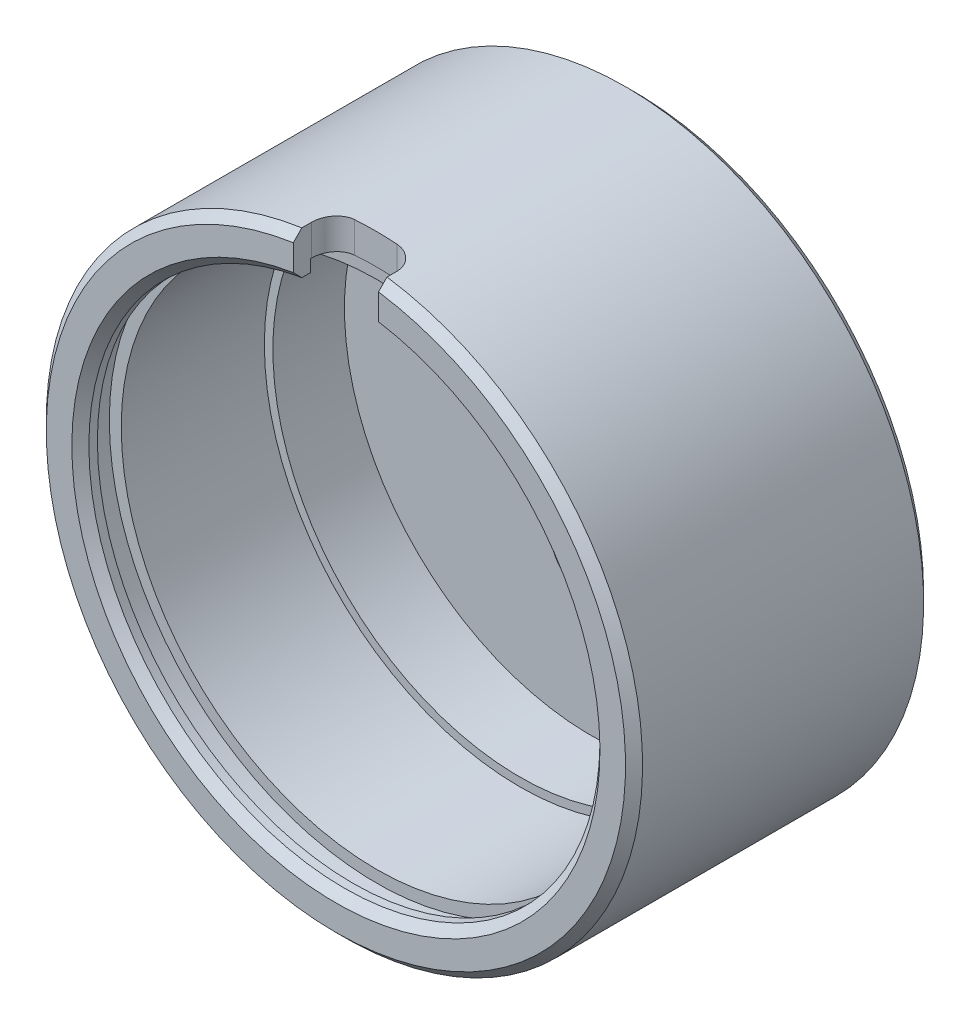
ISO-10303-21;
HEADER;
FILE_DESCRIPTION(('STEP AP214'),'2;1');
FILE_NAME('part.step','',(''),(''),'','','');
FILE_SCHEMA(('AUTOMOTIVE_DESIGN { 1 0 10303 214 1 1 1 1 }'));
ENDSEC;
DATA;
#1=APPLICATION_CONTEXT('core data for automotive mechanical design processes');
#2=APPLICATION_PROTOCOL_DEFINITION('international standard','automotive_design',2000,#1);
#3=PRODUCT_CONTEXT('',#1,'mechanical');
#4=PRODUCT('Part','Part','',(#3));
#5=PRODUCT_RELATED_PRODUCT_CATEGORY('part','',(#4));
#6=PRODUCT_DEFINITION_FORMATION('','',#4);
#7=PRODUCT_DEFINITION_CONTEXT('part definition',#1,'design');
#8=PRODUCT_DEFINITION('design','',#6,#7);
#9=PRODUCT_DEFINITION_SHAPE('','',#8);
#10=(LENGTH_UNIT() NAMED_UNIT(*) SI_UNIT(.MILLI.,.METRE.));
#11=(NAMED_UNIT(*) PLANE_ANGLE_UNIT() SI_UNIT($,.RADIAN.));
#12=(NAMED_UNIT(*) SI_UNIT($,.STERADIAN.) SOLID_ANGLE_UNIT());
#13=UNCERTAINTY_MEASURE_WITH_UNIT(LENGTH_MEASURE(1.E-05),#10,'distance_accuracy_value','');
#14=(GEOMETRIC_REPRESENTATION_CONTEXT(3) GLOBAL_UNCERTAINTY_ASSIGNED_CONTEXT((#13)) GLOBAL_UNIT_ASSIGNED_CONTEXT((#10,
#11,#12)) REPRESENTATION_CONTEXT('',''));
#15=CARTESIAN_POINT('',(0.,0.,0.));
#16=DIRECTION('',(0.,0.,1.));
#17=DIRECTION('',(1.,0.,0.));
#18=AXIS2_PLACEMENT_3D('',#15,#16,#17);
#19=CARTESIAN_POINT('',(0.,-36.83,-10.16));
#20=DIRECTION('',(0.,0.,1.));
#21=DIRECTION('',(1.,0.,0.));
#22=AXIS2_PLACEMENT_3D('',#19,#20,#21);
#23=PLANE('',#22);
#24=CARTESIAN_POINT('',(-0.800871738990831,-13.9328498086649,-10.16));
#25=DIRECTION('',(0.,0.,1.));
#26=DIRECTION('',(1.,0.,0.));
#27=AXIS2_PLACEMENT_3D('',#24,#25,#26);
#28=CIRCLE('',#27,5.207);
#29=CARTESIAN_POINT('',(4.40612826100917,-13.9328498086649,-10.16));
#30=VERTEX_POINT('',#29);
#31=EDGE_CURVE('E585',#30,#30,#28,.F.);
#32=ORIENTED_EDGE('',*,*,#31,.T.);
#33=EDGE_LOOP('',(#32));
#34=FACE_BOUND('',#33,.T.);
#35=CARTESIAN_POINT('',(-6.33232695472631,14.1088287151603,-10.16));
#36=DIRECTION('',(0.,0.,1.));
#37=DIRECTION('',(1.,0.,0.));
#38=AXIS2_PLACEMENT_3D('',#35,#36,#37);
#39=CIRCLE('',#38,3.3);
#40=CARTESIAN_POINT('',(-3.03232695472631,14.1088287151603,-10.16));
#41=VERTEX_POINT('',#40);
#42=EDGE_CURVE('E579',#41,#41,#39,.F.);
#43=ORIENTED_EDGE('',*,*,#42,.T.);
#44=EDGE_LOOP('',(#43));
#45=FACE_BOUND('',#44,.T.);
#46=CARTESIAN_POINT('',(24.1351224598849,0.,-10.16));
#47=DIRECTION('',(0.,0.,1.));
#48=DIRECTION('',(1.,0.,0.));
#49=AXIS2_PLACEMENT_3D('',#46,#47,#48);
#50=CIRCLE('',#49,5.1562);
#51=CARTESIAN_POINT('',(29.2913224598849,0.,-10.16));
#52=VERTEX_POINT('',#51);
#53=EDGE_CURVE('E167',#52,#52,#50,.T.);
#54=ORIENTED_EDGE('',*,*,#53,.F.);
#55=EDGE_LOOP('',(#54));
#56=FACE_BOUND('',#55,.T.);
#57=CARTESIAN_POINT('',(0.,0.,-10.16));
#58=DIRECTION('',(0.,0.,1.));
#59=DIRECTION('',(1.,0.,0.));
#60=AXIS2_PLACEMENT_3D('',#57,#58,#59);
#61=CIRCLE('',#60,1.28904999999999);
#62=CARTESIAN_POINT('',(1.28904999999999,0.,-10.16));
#63=VERTEX_POINT('',#62);
#64=EDGE_CURVE('E161',#63,#63,#61,.T.);
#65=ORIENTED_EDGE('',*,*,#64,.F.);
#66=EDGE_LOOP('',(#65));
#67=FACE_BOUND('',#66,.T.);
#68=CARTESIAN_POINT('',(0.,0.,-10.16));
#69=DIRECTION('',(0.,0.,1.));
#70=DIRECTION('',(1.,0.,0.));
#71=AXIS2_PLACEMENT_3D('',#68,#69,#70);
#72=CIRCLE('',#71,36.83);
#73=CARTESIAN_POINT('',(36.83,0.,-10.16));
#74=VERTEX_POINT('',#73);
#75=EDGE_CURVE('E249',#74,#74,#72,.T.);
#76=ORIENTED_EDGE('',*,*,#75,.T.);
#77=EDGE_LOOP('',(#76));
#78=FACE_BOUND('',#77,.T.);
#79=ADVANCED_FACE('F69',(#34,#45,#56,#67,#78),#23,.T.);
#80=CARTESIAN_POINT('',(0.,0.,-16.51));
#81=DIRECTION('',(0.,0.,-1.));
#82=DIRECTION('',(-1.,0.,0.));
#83=AXIS2_PLACEMENT_3D('',#80,#81,#82);
#84=PLANE('',#83);
#85=CARTESIAN_POINT('',(-0.800871738990831,-13.9328498086649,-16.51));
#86=DIRECTION('',(0.,0.,-1.));
#87=DIRECTION('',(-1.,0.,0.));
#88=AXIS2_PLACEMENT_3D('',#85,#86,#87);
#89=CIRCLE('',#88,5.207);
#90=CARTESIAN_POINT('',(-6.00787173899083,-13.9328498086649,-16.51));
#91=VERTEX_POINT('',#90);
#92=EDGE_CURVE('E578',#91,#91,#89,.T.);
#93=ORIENTED_EDGE('',*,*,#92,.F.);
#94=EDGE_LOOP('',(#93));
#95=FACE_BOUND('',#94,.T.);
#96=CARTESIAN_POINT('',(-6.33232695472631,14.1088287151603,-16.51));
#97=DIRECTION('',(0.,0.,-1.));
#98=DIRECTION('',(-1.,0.,0.));
#99=AXIS2_PLACEMENT_3D('',#96,#97,#98);
#100=CIRCLE('',#99,3.3);
#101=CARTESIAN_POINT('',(-9.63232695472631,14.1088287151603,-16.51));
#102=VERTEX_POINT('',#101);
#103=EDGE_CURVE('E582',#102,#102,#100,.T.);
#104=ORIENTED_EDGE('',*,*,#103,.F.);
#105=EDGE_LOOP('',(#104));
#106=FACE_BOUND('',#105,.T.);
#107=CARTESIAN_POINT('',(24.1351224598849,0.,-16.51));
#108=DIRECTION('',(0.,0.,-1.));
#109=DIRECTION('',(-1.,0.,0.));
#110=AXIS2_PLACEMENT_3D('',#107,#108,#109);
#111=CIRCLE('',#110,9.525);
#112=CARTESIAN_POINT('',(14.6101224598849,0.,-16.51));
#113=VERTEX_POINT('',#112);
#114=EDGE_CURVE('E575',#113,#113,#111,.T.);
#115=ORIENTED_EDGE('',*,*,#114,.F.);
#116=EDGE_LOOP('',(#115));
#117=FACE_BOUND('',#116,.T.);
#118=CARTESIAN_POINT('',(0.,0.,-16.51));
#119=DIRECTION('',(0.,0.,-1.));
#120=DIRECTION('',(-1.,0.,0.));
#121=AXIS2_PLACEMENT_3D('',#118,#119,#120);
#122=CIRCLE('',#121,43.18);
#123=CARTESIAN_POINT('',(-43.18,0.,-16.51));
#124=VERTEX_POINT('',#123);
#125=EDGE_CURVE('E304',#124,#124,#122,.T.);
#126=ORIENTED_EDGE('',*,*,#125,.T.);
#127=EDGE_LOOP('',(#126));
#128=FACE_BOUND('',#127,.T.);
#129=ADVANCED_FACE('F334',(#95,#106,#117,#128),#84,.T.);
#130=CARTESIAN_POINT('',(0.,0.,77.4031578947368));
#131=DIRECTION('',(0.,0.,1.));
#132=DIRECTION('',(1.,0.,0.));
#133=AXIS2_PLACEMENT_3D('',#130,#131,#132);
#134=CYLINDRICAL_SURFACE('',#133,44.45);
#135=CARTESIAN_POINT('',(0.,0.,-15.24));
#136=DIRECTION('',(0.,0.,-1.));
#137=DIRECTION('',(-1.,0.,0.));
#138=AXIS2_PLACEMENT_3D('',#135,#136,#137);
#139=CIRCLE('',#138,44.45);
#140=CARTESIAN_POINT('',(-44.45,0.,-15.24));
#141=VERTEX_POINT('',#140);
#142=EDGE_CURVE('E282',#141,#141,#139,.F.);
#143=ORIENTED_EDGE('',*,*,#142,.T.);
#144=EDGE_LOOP('',(#143));
#145=FACE_BOUND('',#144,.T.);
#146=DIRECTION('',(0.,0.,1.));
#147=VECTOR('',#146,1.);
#148=CARTESIAN_POINT('',(6.35,43.9940905122495,77.4031578947368));
#149=LINE('',#148,#147);
#150=CARTESIAN_POINT('',(6.35,43.9940905122495,25.1968));
#151=VERTEX_POINT('',#150);
#152=CARTESIAN_POINT('',(6.35,43.9940905122495,26.6699999999999));
#153=VERTEX_POINT('',#152);
#154=EDGE_CURVE('E164',#151,#153,#149,.T.);
#155=ORIENTED_EDGE('',*,*,#154,.T.);
#156=CARTESIAN_POINT('',(0.,0.,26.6699999999999));
#157=DIRECTION('',(0.,0.,1.));
#158=DIRECTION('',(1.,0.,0.));
#159=AXIS2_PLACEMENT_3D('',#156,#157,#158);
#160=CIRCLE('',#159,44.45);
#161=CARTESIAN_POINT('',(-6.35,43.9940905122495,26.6699999999999));
#162=VERTEX_POINT('',#161);
#163=EDGE_CURVE('E313',#153,#162,#160,.F.);
#164=ORIENTED_EDGE('',*,*,#163,.T.);
#165=DIRECTION('',(0.,0.,1.));
#166=VECTOR('',#165,1.);
#167=CARTESIAN_POINT('',(-6.35,43.9940905122495,77.4031578947368));
#168=LINE('',#167,#166);
#169=CARTESIAN_POINT('',(-6.35,43.9940905122495,25.1968));
#170=VERTEX_POINT('',#169);
#171=EDGE_CURVE('E199',#162,#170,#168,.F.);
#172=ORIENTED_EDGE('',*,*,#171,.T.);
#173=CARTESIAN_POINT('',(-6.35,43.9940905122495,25.1968));
#174=CARTESIAN_POINT('',(-6.35000906712452,43.9940871907118,25.1080683586263));
#175=CARTESIAN_POINT('',(-6.34628039485997,43.9946273388962,25.019341226491));
#176=CARTESIAN_POINT('',(-6.33141771745465,43.9967698007436,24.8425289532975));
#177=CARTESIAN_POINT('',(-6.32028428633954,43.9983720320727,24.7544437630102));
#178=CARTESIAN_POINT('',(-6.29069877668047,44.0026115204418,24.5796322428402));
#179=CARTESIAN_POINT('',(-6.27225490035148,44.0052476174647,24.492904502894));
#180=CARTESIAN_POINT('',(-6.22820563540591,44.0115035518271,24.3213490506435));
#181=CARTESIAN_POINT('',(-6.20260029104134,44.0151233830879,24.2365213266021));
#182=CARTESIAN_POINT('',(-6.11527156229012,44.0273717624754,23.9857274174484));
#183=CARTESIAN_POINT('',(-6.04301894879132,44.0373916403267,23.8233534494161));
#184=CARTESIAN_POINT('',(-5.87265552531039,44.0604329743206,23.5131617230431));
#185=CARTESIAN_POINT('',(-5.77454619781926,44.0734542583726,23.3653431308392));
#186=CARTESIAN_POINT('',(-5.55461499748338,44.1017129183868,23.0873870955229));
#187=CARTESIAN_POINT('',(-5.4326623997553,44.1169623886948,22.9573541676829));
#188=CARTESIAN_POINT('',(-5.16881406394802,44.1486520757181,22.7195257979547));
#189=CARTESIAN_POINT('',(-5.02691387614281,44.1650925577158,22.6117353309877));
#190=CARTESIAN_POINT('',(-4.72591436649334,44.1983180962436,22.4205903646293));
#191=CARTESIAN_POINT('',(-4.56668428352384,44.2151048691079,22.3374422019247));
#192=CARTESIAN_POINT('',(-4.23647193888471,44.2479633610308,22.1991513450227));
#193=CARTESIAN_POINT('',(-4.06549652386819,44.2640354878229,22.1439924898119));
#194=CARTESIAN_POINT('',(-3.77381023101254,44.2896686903174,22.0764505130364));
#195=CARTESIAN_POINT('',(-3.6549454231235,44.2996402809604,22.0559777704057));
#196=CARTESIAN_POINT('',(-3.4157498591215,44.3187284009984,22.0286525611385));
#197=CARTESIAN_POINT('',(-3.29542118965897,44.3278460157872,22.0217825754514));
#198=CARTESIAN_POINT('',(-3.175,44.3364621389664,22.0218));
#199=B_SPLINE_CURVE_WITH_KNOTS('',3,(#173,#174,#175,#176,#177,#178,#179,#180,#181,#182,#183,
#184,#185,#186,#187,#188,#189,#190,#191,#192,#193,#194,#195,#196,#197,#198),.UNSPECIFIED.,.F.,
.F.,(4,2,2,2,2,2,2,2,2,2,2,2,4),(0.,0.266106949016901,0.53219327151295,0.797981890241406,
1.06376886665041,1.59505111623775,2.1263029114573,2.66055348014999,3.19492341424903,
3.73364894965103,4.27206307020903,4.63441276915479,4.99629549199466),.UNSPECIFIED.);
#200=CARTESIAN_POINT('',(-3.175,44.3364621389664,22.0218));
#201=VERTEX_POINT('',#200);
#202=EDGE_CURVE('E173',#170,#201,#199,.T.);
#203=ORIENTED_EDGE('',*,*,#202,.T.);
#204=CARTESIAN_POINT('',(0.,0.,22.0218));
#205=DIRECTION('',(0.,0.,-1.));
#206=DIRECTION('',(-1.,0.,0.));
#207=AXIS2_PLACEMENT_3D('',#204,#205,#206);
#208=CIRCLE('',#207,44.45);
#209=CARTESIAN_POINT('',(3.175,44.3364621389664,22.0218));
#210=VERTEX_POINT('',#209);
#211=EDGE_CURVE('E171',#201,#210,#208,.T.);
#212=ORIENTED_EDGE('',*,*,#211,.T.);
#213=CARTESIAN_POINT('',(3.175,44.3364621389664,22.0218));
#214=CARTESIAN_POINT('',(3.26464210246061,44.3300453883799,22.021791476705));
#215=CARTESIAN_POINT('',(3.35425933250769,44.3233519088657,22.0255963389268));
#216=CARTESIAN_POINT('',(3.5328084431574,44.3094766450206,22.0407563760059));
#217=CARTESIAN_POINT('',(3.62174037371441,44.3022948966638,22.0521109951608));
#218=CARTESIAN_POINT('',(3.79822057609016,44.287513657162,22.0822811018134));
#219=CARTESIAN_POINT('',(3.88576997438769,44.2799145313936,22.1010901505461));
#220=CARTESIAN_POINT('',(4.05891874081297,44.264379023971,22.1460093897201));
#221=CARTESIAN_POINT('',(4.14451811820336,44.2564426439194,22.1721195454732));
#222=CARTESIAN_POINT('',(4.39755150592715,44.2322577180715,22.2611740946118));
#223=CARTESIAN_POINT('',(4.56131476060427,44.2156254354903,22.3348587395882));
#224=CARTESIAN_POINT('',(4.87399943054111,44.1822526287407,22.5086659156951));
#225=CARTESIAN_POINT('',(5.02292248061916,44.1655121167119,22.6087855302667));
#226=CARTESIAN_POINT('',(5.30221473087846,44.1328544690922,22.8329679223237));
#227=CARTESIAN_POINT('',(5.43254044891726,44.1169393167831,22.957085264454));
#228=CARTESIAN_POINT('',(5.67049931498289,44.0869863783097,23.2256819195872));
#229=CARTESIAN_POINT('',(5.7781285346606,44.072948917293,23.3701647502757));
#230=CARTESIAN_POINT('',(5.96724132033841,44.0477426758777,23.674930454286));
#231=CARTESIAN_POINT('',(6.04880388942302,44.0365652481919,23.8351636232061));
#232=CARTESIAN_POINT('',(6.18376470169447,44.01781718456,24.1672260481747));
#233=CARTESIAN_POINT('',(6.23718270556066,44.0102440183754,24.339047072367));
#234=CARTESIAN_POINT('',(6.30040922876563,44.0012267812188,24.626151525687));
#235=CARTESIAN_POINT('',(6.3189926484693,43.9985579207836,24.7395405095559));
#236=CARTESIAN_POINT('',(6.34378687617685,43.9949873823032,24.967535889658));
#237=CARTESIAN_POINT('',(6.35001427414841,43.9940833347363,25.0821404455195));
#238=CARTESIAN_POINT('',(6.35,43.9940905122495,25.1968));
#239=B_SPLINE_CURVE_WITH_KNOTS('',3,(#213,#214,#215,#216,#217,#218,#219,#220,#221,#222,#223,
#224,#225,#226,#227,#228,#229,#230,#231,#232,#233,#234,#235,#236,#237,#238),.UNSPECIFIED.,.F.,
.F.,(4,2,2,2,2,2,2,2,2,2,2,2,4),(0.,0.269524707992234,0.539029579719346,0.808302172135232,
1.07757348523338,1.61583261920689,2.15403239207581,2.69347059746959,3.233002093265,
3.77088251300263,4.30838477467037,4.65254658049778,4.99624597961314),.UNSPECIFIED.);
#240=EDGE_CURVE('E160',#210,#151,#239,.T.);
#241=ORIENTED_EDGE('',*,*,#240,.T.);
#242=EDGE_LOOP('',(#155,#164,#172,#203,#212,#241));
#243=FACE_BOUND('',#242,.T.);
#244=ADVANCED_FACE('F321',(#145,#243),#134,.T.);
#245=CARTESIAN_POINT('',(0.,-44.45,27.94));
#246=DIRECTION('',(0.,0.,1.));
#247=DIRECTION('',(1.,0.,0.));
#248=AXIS2_PLACEMENT_3D('',#245,#246,#247);
#249=PLANE('',#248);
#250=DIRECTION('',(0.,1.,0.));
#251=VECTOR('',#250,1.);
#252=CARTESIAN_POINT('',(6.35,-44.451,27.94));
#253=LINE('',#252,#251);
#254=CARTESIAN_POINT('',(6.35,38.854528693577,27.94));
#255=VERTEX_POINT('',#254);
#256=CARTESIAN_POINT('',(6.35,42.7105361708326,27.94));
#257=VERTEX_POINT('',#256);
#258=EDGE_CURVE('E243',#255,#257,#253,.T.);
#259=ORIENTED_EDGE('',*,*,#258,.F.);
#260=CARTESIAN_POINT('',(0.,0.,27.94));
#261=DIRECTION('',(0.,0.,1.));
#262=DIRECTION('',(1.,0.,0.));
#263=AXIS2_PLACEMENT_3D('',#260,#261,#262);
#264=CIRCLE('',#263,39.37);
#265=CARTESIAN_POINT('',(-6.35,38.854528693577,27.94));
#266=VERTEX_POINT('',#265);
#267=EDGE_CURVE('E83',#255,#266,#264,.F.);
#268=ORIENTED_EDGE('',*,*,#267,.T.);
#269=DIRECTION('',(0.,1.,0.));
#270=VECTOR('',#269,1.);
#271=CARTESIAN_POINT('',(-6.35,-44.451,27.94));
#272=LINE('',#271,#270);
#273=CARTESIAN_POINT('',(-6.35,42.7105361708326,27.94));
#274=VERTEX_POINT('',#273);
#275=EDGE_CURVE('E229',#266,#274,#272,.T.);
#276=ORIENTED_EDGE('',*,*,#275,.T.);
#277=CARTESIAN_POINT('',(0.,0.,27.94));
#278=DIRECTION('',(0.,0.,1.));
#279=DIRECTION('',(1.,0.,0.));
#280=AXIS2_PLACEMENT_3D('',#277,#278,#279);
#281=CIRCLE('',#280,43.18);
#282=EDGE_CURVE('E272',#274,#257,#281,.T.);
#283=ORIENTED_EDGE('',*,*,#282,.T.);
#284=EDGE_LOOP('',(#259,#268,#276,#283));
#285=FACE_BOUND('',#284,.T.);
#286=ADVANCED_FACE('F346',(#285),#249,.T.);
#287=CARTESIAN_POINT('',(0.,0.,77.4031578947368));
#288=DIRECTION('',(0.,0.,1.));
#289=DIRECTION('',(1.,0.,0.));
#290=AXIS2_PLACEMENT_3D('',#287,#288,#289);
#291=CYLINDRICAL_SURFACE('',#290,38.1);
#292=DIRECTION('',(0.,0.,1.));
#293=VECTOR('',#292,1.);
#294=CARTESIAN_POINT('',(-6.35,37.5671066226826,77.4031578947368));
#295=LINE('',#294,#293);
#296=CARTESIAN_POINT('',(-6.35,37.5671066226826,25.4));
#297=VERTEX_POINT('',#296);
#298=CARTESIAN_POINT('',(-6.35,37.5671066226826,26.67));
#299=VERTEX_POINT('',#298);
#300=EDGE_CURVE('E203',#297,#299,#295,.T.);
#301=ORIENTED_EDGE('',*,*,#300,.T.);
#302=CARTESIAN_POINT('',(0.,0.,26.67));
#303=DIRECTION('',(0.,0.,1.));
#304=DIRECTION('',(1.,0.,0.));
#305=AXIS2_PLACEMENT_3D('',#302,#303,#304);
#306=CIRCLE('',#305,38.1);
#307=CARTESIAN_POINT('',(6.35,37.5671066226826,26.67));
#308=VERTEX_POINT('',#307);
#309=EDGE_CURVE('E301',#299,#308,#306,.T.);
#310=ORIENTED_EDGE('',*,*,#309,.T.);
#311=DIRECTION('',(0.,0.,1.));
#312=VECTOR('',#311,1.);
#313=CARTESIAN_POINT('',(6.35,37.5671066226826,77.4031578947368));
#314=LINE('',#313,#312);
#315=CARTESIAN_POINT('',(6.35,37.5671066226826,25.4));
#316=VERTEX_POINT('',#315);
#317=EDGE_CURVE('E201',#308,#316,#314,.F.);
#318=ORIENTED_EDGE('',*,*,#317,.T.);
#319=CARTESIAN_POINT('',(0.,0.,25.4));
#320=DIRECTION('',(0.,0.,1.));
#321=DIRECTION('',(1.,0.,0.));
#322=AXIS2_PLACEMENT_3D('',#319,#320,#321);
#323=CIRCLE('',#322,38.1);
#324=EDGE_CURVE('E269',#297,#316,#323,.T.);
#325=ORIENTED_EDGE('',*,*,#324,.F.);
#326=EDGE_LOOP('',(#301,#310,#318,#325));
#327=FACE_BOUND('',#326,.T.);
#328=ADVANCED_FACE('F349',(#327),#291,.F.);
#329=CARTESIAN_POINT('',(0.,-38.1,25.4));
#330=DIRECTION('',(0.,0.,-1.));
#331=DIRECTION('',(-1.,0.,0.));
#332=AXIS2_PLACEMENT_3D('',#329,#330,#331);
#333=PLANE('',#332);
#334=DIRECTION('',(0.,1.,0.));
#335=VECTOR('',#334,1.);
#336=CARTESIAN_POINT('',(6.35,-44.451,25.4));
#337=LINE('',#336,#335);
#338=CARTESIAN_POINT('',(6.35,39.3691806366351,25.4));
#339=VERTEX_POINT('',#338);
#340=EDGE_CURVE('E246',#316,#339,#337,.T.);
#341=ORIENTED_EDGE('',*,*,#340,.T.);
#342=CARTESIAN_POINT('',(0.,0.,25.4));
#343=DIRECTION('',(0.,0.,1.));
#344=DIRECTION('',(1.,0.,0.));
#345=AXIS2_PLACEMENT_3D('',#342,#343,#344);
#346=CIRCLE('',#345,39.878);
#347=CARTESIAN_POINT('',(-6.35,39.3691806366351,25.4));
#348=VERTEX_POINT('',#347);
#349=EDGE_CURVE('E266',#348,#339,#346,.T.);
#350=ORIENTED_EDGE('',*,*,#349,.F.);
#351=DIRECTION('',(0.,-1.,0.));
#352=VECTOR('',#351,1.);
#353=CARTESIAN_POINT('',(-6.35,-44.451,25.4));
#354=LINE('',#353,#352);
#355=EDGE_CURVE('E226',#348,#297,#354,.T.);
#356=ORIENTED_EDGE('',*,*,#355,.T.);
#357=ORIENTED_EDGE('',*,*,#324,.T.);
#358=EDGE_LOOP('',(#341,#350,#356,#357));
#359=FACE_BOUND('',#358,.T.);
#360=ADVANCED_FACE('F352',(#359),#333,.T.);
#361=CARTESIAN_POINT('',(0.,0.,77.4031578947368));
#362=DIRECTION('',(0.,0.,1.));
#363=DIRECTION('',(1.,0.,0.));
#364=AXIS2_PLACEMENT_3D('',#361,#362,#363);
#365=CYLINDRICAL_SURFACE('',#364,39.878);
#366=DIRECTION('',(0.,0.,1.));
#367=VECTOR('',#366,1.);
#368=CARTESIAN_POINT('',(6.35,39.3691806366351,77.4031578947368));
#369=LINE('',#368,#367);
#370=CARTESIAN_POINT('',(6.35,39.3691806366351,25.1968));
#371=VERTEX_POINT('',#370);
#372=EDGE_CURVE('E233',#339,#371,#369,.F.);
#373=ORIENTED_EDGE('',*,*,#372,.T.);
#374=CARTESIAN_POINT('',(6.35,39.3691806366351,25.1968));
#375=CARTESIAN_POINT('',(6.35000918989738,39.3691769085199,25.1082072491254));
#376=CARTESIAN_POINT('',(6.34629203896572,39.3697786492952,25.0196191190065));
#377=CARTESIAN_POINT('',(6.33147614733022,39.3721652550012,24.8430856153806));
#378=CARTESIAN_POINT('',(6.32037803243072,39.3739500196276,24.7551401880203));
#379=CARTESIAN_POINT('',(6.2908890826286,39.3786720178665,24.5806157191135));
#380=CARTESIAN_POINT('',(6.27250706270827,39.3816078584018,24.4940351570144));
#381=CARTESIAN_POINT('',(6.22860874231544,39.3885745689136,24.3227724174951));
#382=CARTESIAN_POINT('',(6.20309247531096,39.3926054337531,24.2380902311712));
#383=CARTESIAN_POINT('',(6.11607652331386,39.4062430781821,23.987734115986));
#384=CARTESIAN_POINT('',(6.04409212687481,39.4173978085727,23.8256474218782));
#385=CARTESIAN_POINT('',(5.874388314056,39.4430444928886,23.5159818089103));
#386=CARTESIAN_POINT('',(5.7766696389662,39.4575363506846,23.368402472326));
#387=CARTESIAN_POINT('',(5.55748806173131,39.4890050895989,23.0906488523494));
#388=CARTESIAN_POINT('',(5.43586338135539,39.5059986921741,22.9606039463036));
#389=CARTESIAN_POINT('',(5.17270910120663,39.5413145188024,22.72268179505));
#390=CARTESIAN_POINT('',(5.03117492771479,39.5596370476742,22.6148096575474));
#391=CARTESIAN_POINT('',(4.73062168184645,39.5967073903414,22.4232187349122));
#392=CARTESIAN_POINT('',(4.57144032145715,39.6154576309165,22.3397551339368));
#393=CARTESIAN_POINT('',(4.24125160384196,39.65216499771,22.2008414897525));
#394=CARTESIAN_POINT('',(4.07025111146418,39.670122574558,22.145375337818));
#395=CARTESIAN_POINT('',(3.77777363998267,39.6988337702232,22.0771834822775));
#396=CARTESIAN_POINT('',(3.65814909794796,39.710040178219,22.0564384112871));
#397=CARTESIAN_POINT('',(3.41738263742117,39.7314879181353,22.0287462832725));
#398=CARTESIAN_POINT('',(3.29624281228372,39.7417304439037,22.0217819376085));
#399=CARTESIAN_POINT('',(3.175,39.7514057487279,22.0218));
#400=B_SPLINE_CURVE_WITH_KNOTS('',3,(#374,#375,#376,#377,#378,#379,#380,#381,#382,#383,#384,
#385,#386,#387,#388,#389,#390,#391,#392,#393,#394,#395,#396,#397,#398,#399),.UNSPECIFIED.,.F.,
.F.,(4,2,2,2,2,2,2,2,2,2,2,2,4),(0.,0.265690066667046,0.531357609338184,0.796704618285728,
1.06205038246434,1.59243167000925,2.12279768130188,2.65688471357383,3.19109464025657,
3.73070477867748,4.27000408991414,4.63503699698284,4.99961166011968),.UNSPECIFIED.);
#401=CARTESIAN_POINT('',(3.175,39.7514057487279,22.0218));
#402=VERTEX_POINT('',#401);
#403=EDGE_CURVE('E206',#371,#402,#400,.T.);
#404=ORIENTED_EDGE('',*,*,#403,.T.);
#405=CARTESIAN_POINT('',(0.,0.,22.0218));
#406=DIRECTION('',(0.,0.,-1.));
#407=DIRECTION('',(-1.,0.,0.));
#408=AXIS2_PLACEMENT_3D('',#405,#406,#407);
#409=CIRCLE('',#408,39.878);
#410=CARTESIAN_POINT('',(-3.175,39.7514057487279,22.0218));
#411=VERTEX_POINT('',#410);
#412=EDGE_CURVE('E207',#402,#411,#409,.F.);
#413=ORIENTED_EDGE('',*,*,#412,.T.);
#414=CARTESIAN_POINT('',(-3.175,39.7514057487279,22.0218));
#415=CARTESIAN_POINT('',(-3.26472472537003,39.7442422785343,22.021791485229));
#416=CARTESIAN_POINT('',(-3.35441945131399,39.7367696116614,22.0256033336854));
#417=CARTESIAN_POINT('',(-3.53311212896381,39.7212787204031,22.0407887668983));
#418=CARTESIAN_POINT('',(-3.62211013576057,39.7132605396484,22.0521617475447));
#419=CARTESIAN_POINT('',(-3.7987086460619,39.6967576237021,22.082377049294));
#420=CARTESIAN_POINT('',(-3.88631032101552,39.6882733093837,22.1012127247569));
#421=CARTESIAN_POINT('',(-4.05955307406708,39.6709277381744,22.1461917020309));
#422=CARTESIAN_POINT('',(-4.14519415789681,39.6620664823857,22.1723349824752));
#423=CARTESIAN_POINT('',(-4.39833303278445,39.6350630091174,22.2614942666175));
#424=CARTESIAN_POINT('',(-4.56214592813298,39.6164916959405,22.3352568460535));
#425=CARTESIAN_POINT('',(-4.87490953112382,39.5792248574268,22.5092361462295));
#426=CARTESIAN_POINT('',(-5.02386163303209,39.5605293439187,22.6094503820058));
#427=CARTESIAN_POINT('',(-5.30328166604762,39.5240434089742,22.8339141356933));
#428=CARTESIAN_POINT('',(-5.4336951472413,39.5062557482257,22.9582320197843));
#429=CARTESIAN_POINT('',(-5.67178849390104,39.4727779830176,23.2272953406611));
#430=CARTESIAN_POINT('',(-5.77946454859068,39.4570882303272,23.3720441948911));
#431=CARTESIAN_POINT('',(-5.96853364165833,39.4289312814348,23.6772896769332));
#432=CARTESIAN_POINT('',(-6.05002627955017,39.416451910229,23.8377235263492));
#433=CARTESIAN_POINT('',(-6.18479863050957,39.3955306518549,24.1702243933269));
#434=CARTESIAN_POINT('',(-6.23809895896456,39.3870858149059,24.3422828064071));
#435=CARTESIAN_POINT('',(-6.30091824147337,39.3770734995218,24.6290675389932));
#436=CARTESIAN_POINT('',(-6.31931047384697,39.3741217252918,24.7418801326867));
#437=CARTESIAN_POINT('',(-6.34385031159063,39.370172640765,24.9687111710634));
#438=CARTESIAN_POINT('',(-6.35001410725474,39.3691727462326,25.0827278201282));
#439=CARTESIAN_POINT('',(-6.35,39.3691806366351,25.1968));
#440=B_SPLINE_CURVE_WITH_KNOTS('',3,(#414,#415,#416,#417,#418,#419,#420,#421,#422,#423,#424,
#425,#426,#427,#428,#429,#430,#431,#432,#433,#434,#435,#436,#437,#438,#439),.UNSPECIFIED.,.F.,
.F.,(4,2,2,2,2,2,2,2,2,2,2,2,4),(0.,0.269940353331079,0.539859141892133,0.809538102103209,
1.07921627380604,1.61827229482532,2.15727769299983,2.69783487030827,3.2384825728331,
3.77704865576227,4.31522037044188,4.65761207753016,4.99955015903356),.UNSPECIFIED.);
#441=CARTESIAN_POINT('',(-6.35,39.3691806366351,25.1968));
#442=VERTEX_POINT('',#441);
#443=EDGE_CURVE('E210',#411,#442,#440,.T.);
#444=ORIENTED_EDGE('',*,*,#443,.T.);
#445=DIRECTION('',(0.,0.,1.));
#446=VECTOR('',#445,1.);
#447=CARTESIAN_POINT('',(-6.35,39.3691806366351,77.4031578947368));
#448=LINE('',#447,#446);
#449=EDGE_CURVE('E223',#442,#348,#448,.T.);
#450=ORIENTED_EDGE('',*,*,#449,.T.);
#451=ORIENTED_EDGE('',*,*,#349,.T.);
#452=EDGE_LOOP('',(#373,#404,#413,#444,#450,#451));
#453=FACE_BOUND('',#452,.T.);
#454=CARTESIAN_POINT('',(0.,0.,21.844));
#455=DIRECTION('',(0.,0.,1.));
#456=DIRECTION('',(1.,0.,0.));
#457=AXIS2_PLACEMENT_3D('',#454,#455,#456);
#458=CIRCLE('',#457,39.878);
#459=CARTESIAN_POINT('',(39.878,0.,21.844));
#460=VERTEX_POINT('',#459);
#461=EDGE_CURVE('E263',#460,#460,#458,.T.);
#462=ORIENTED_EDGE('',*,*,#461,.F.);
#463=EDGE_LOOP('',(#462));
#464=FACE_BOUND('',#463,.T.);
#465=ADVANCED_FACE('F356',(#453,#464),#365,.F.);
#466=CARTESIAN_POINT('',(0.,-39.878,21.844));
#467=DIRECTION('',(0.,0.,1.));
#468=DIRECTION('',(1.,0.,0.));
#469=AXIS2_PLACEMENT_3D('',#466,#467,#468);
#470=PLANE('',#469);
#471=ORIENTED_EDGE('',*,*,#461,.T.);
#472=EDGE_LOOP('',(#471));
#473=FACE_BOUND('',#472,.T.);
#474=CARTESIAN_POINT('',(0.,0.,21.844));
#475=DIRECTION('',(0.,0.,1.));
#476=DIRECTION('',(1.,0.,0.));
#477=AXIS2_PLACEMENT_3D('',#474,#475,#476);
#478=CIRCLE('',#477,38.1);
#479=CARTESIAN_POINT('',(38.1,0.,21.844));
#480=VERTEX_POINT('',#479);
#481=EDGE_CURVE('E260',#480,#480,#478,.T.);
#482=ORIENTED_EDGE('',*,*,#481,.F.);
#483=EDGE_LOOP('',(#482));
#484=FACE_BOUND('',#483,.T.);
#485=ADVANCED_FACE('F360',(#473,#484),#470,.T.);
#486=CARTESIAN_POINT('',(0.,0.,77.4031578947368));
#487=DIRECTION('',(0.,0.,1.));
#488=DIRECTION('',(1.,0.,0.));
#489=AXIS2_PLACEMENT_3D('',#486,#487,#488);
#490=CYLINDRICAL_SURFACE('',#489,38.1);
#491=ORIENTED_EDGE('',*,*,#481,.T.);
#492=EDGE_LOOP('',(#491));
#493=FACE_BOUND('',#492,.T.);
#494=CARTESIAN_POINT('',(0.,0.,0.507999999999995));
#495=DIRECTION('',(0.,0.,1.));
#496=DIRECTION('',(1.,0.,0.));
#497=AXIS2_PLACEMENT_3D('',#494,#495,#496);
#498=CIRCLE('',#497,38.1);
#499=CARTESIAN_POINT('',(38.1,0.,0.507999999999995));
#500=VERTEX_POINT('',#499);
#501=EDGE_CURVE('E257',#500,#500,#498,.T.);
#502=ORIENTED_EDGE('',*,*,#501,.F.);
#503=EDGE_LOOP('',(#502));
#504=FACE_BOUND('',#503,.T.);
#505=ADVANCED_FACE('F364',(#493,#504),#490,.F.);
#506=CARTESIAN_POINT('',(0.,-38.1,0.507999999999991));
#507=DIRECTION('',(0.,0.,1.));
#508=DIRECTION('',(1.,0.,0.));
#509=AXIS2_PLACEMENT_3D('',#506,#507,#508);
#510=PLANE('',#509);
#511=ORIENTED_EDGE('',*,*,#501,.T.);
#512=EDGE_LOOP('',(#511));
#513=FACE_BOUND('',#512,.T.);
#514=CARTESIAN_POINT('',(0.,0.,0.507999999999995));
#515=DIRECTION('',(0.,0.,1.));
#516=DIRECTION('',(1.,0.,0.));
#517=AXIS2_PLACEMENT_3D('',#514,#515,#516);
#518=CIRCLE('',#517,36.83);
#519=CARTESIAN_POINT('',(36.83,0.,0.507999999999995));
#520=VERTEX_POINT('',#519);
#521=EDGE_CURVE('E254',#520,#520,#518,.T.);
#522=ORIENTED_EDGE('',*,*,#521,.F.);
#523=EDGE_LOOP('',(#522));
#524=FACE_BOUND('',#523,.T.);
#525=ADVANCED_FACE('F368',(#513,#524),#510,.T.);
#526=CARTESIAN_POINT('',(0.,0.,77.4031578947368));
#527=DIRECTION('',(0.,0.,1.));
#528=DIRECTION('',(1.,0.,0.));
#529=AXIS2_PLACEMENT_3D('',#526,#527,#528);
#530=CYLINDRICAL_SURFACE('',#529,36.83);
#531=ORIENTED_EDGE('',*,*,#521,.T.);
#532=EDGE_LOOP('',(#531));
#533=FACE_BOUND('',#532,.T.);
#534=ORIENTED_EDGE('',*,*,#75,.F.);
#535=EDGE_LOOP('',(#534));
#536=FACE_BOUND('',#535,.T.);
#537=ADVANCED_FACE('F290',(#533,#536),#530,.F.);
#538=CARTESIAN_POINT('',(6.35,-44.451,27.94));
#539=DIRECTION('',(1.,0.,0.));
#540=DIRECTION('',(0.,0.,-1.));
#541=AXIS2_PLACEMENT_3D('',#538,#539,#540);
#542=PLANE('',#541);
#543=ORIENTED_EDGE('',*,*,#317,.F.);
#544=CARTESIAN_POINT('',(6.35,37.5671066226826,26.67));
#545=CARTESIAN_POINT('',(6.35,37.7817248912174,26.8816180859501));
#546=CARTESIAN_POINT('',(6.35,37.9963191980819,27.0932604622807));
#547=CARTESIAN_POINT('',(6.35,38.4254598883801,27.516593795614));
#548=CARTESIAN_POINT('',(6.35,38.6400062718137,27.7282847526168));
#549=CARTESIAN_POINT('',(6.35,38.854528693577,27.94));
#550=B_SPLINE_CURVE_WITH_KNOTS('',3,(#544,#545,#546,#547,#548,#549),.UNSPECIFIED.,.F.,.F.,(4,2,
4),(0.,0.904206230888576,1.80841246139722),.UNSPECIFIED.);
#551=EDGE_CURVE('E97',#308,#255,#550,.T.);
#552=ORIENTED_EDGE('',*,*,#551,.T.);
#553=ORIENTED_EDGE('',*,*,#258,.T.);
#554=CARTESIAN_POINT('',(6.35,42.7105361708326,27.94));
#555=CARTESIAN_POINT('',(6.35,42.9244948072336,27.7283665973965));
#556=CARTESIAN_POINT('',(6.35,43.1384369872283,27.5167165627521));
#557=CARTESIAN_POINT('',(6.35,43.5662884343672,27.0933832294188));
#558=CARTESIAN_POINT('',(6.35,43.7801977015116,26.8816999307298));
#559=CARTESIAN_POINT('',(6.35,43.9940905122495,26.6699999999999));
#560=B_SPLINE_CURVE_WITH_KNOTS('',3,(#554,#555,#556,#557,#558,#559),.UNSPECIFIED.,.F.,.F.,(4,2,
4),(0.,0.902830516715259,1.80566103327233),.UNSPECIFIED.);
#561=EDGE_CURVE('E275',#257,#153,#560,.T.);
#562=ORIENTED_EDGE('',*,*,#561,.T.);
#563=ORIENTED_EDGE('',*,*,#154,.F.);
#564=DIRECTION('',(0.,1.,0.));
#565=VECTOR('',#564,1.);
#566=CARTESIAN_POINT('',(6.35,-44.451,25.1968));
#567=LINE('',#566,#565);
#568=EDGE_CURVE('E240',#371,#151,#567,.T.);
#569=ORIENTED_EDGE('',*,*,#568,.F.);
#570=ORIENTED_EDGE('',*,*,#372,.F.);
#571=ORIENTED_EDGE('',*,*,#340,.F.);
#572=EDGE_LOOP('',(#543,#552,#553,#562,#563,#569,#570,#571));
#573=FACE_BOUND('',#572,.T.);
#574=ADVANCED_FACE('F287',(#573),#542,.F.);
#575=CARTESIAN_POINT('',(3.175,-44.451,25.1968));
#576=DIRECTION('',(0.,1.,0.));
#577=DIRECTION('',(0.,0.,1.));
#578=AXIS2_PLACEMENT_3D('',#575,#576,#577);
#579=CYLINDRICAL_SURFACE('',#578,3.175);
#580=DIRECTION('',(0.,1.,0.));
#581=VECTOR('',#580,1.);
#582=CARTESIAN_POINT('',(3.175,-44.451,22.0218));
#583=LINE('',#582,#581);
#584=EDGE_CURVE('E237',#402,#210,#583,.T.);
#585=ORIENTED_EDGE('',*,*,#584,.F.);
#586=ORIENTED_EDGE('',*,*,#403,.F.);
#587=ORIENTED_EDGE('',*,*,#568,.T.);
#588=ORIENTED_EDGE('',*,*,#240,.F.);
#589=EDGE_LOOP('',(#585,#586,#587,#588));
#590=FACE_BOUND('',#589,.T.);
#591=ADVANCED_FACE('F182',(#590),#579,.F.);
#592=CARTESIAN_POINT('',(-3.175,-44.451,22.0218));
#593=DIRECTION('',(0.,0.,-1.));
#594=DIRECTION('',(-1.,0.,0.));
#595=AXIS2_PLACEMENT_3D('',#592,#593,#594);
#596=PLANE('',#595);
#597=DIRECTION('',(0.,1.,0.));
#598=VECTOR('',#597,1.);
#599=CARTESIAN_POINT('',(-3.175,-44.451,22.0218));
#600=LINE('',#599,#598);
#601=EDGE_CURVE('E234',#411,#201,#600,.T.);
#602=ORIENTED_EDGE('',*,*,#601,.F.);
#603=ORIENTED_EDGE('',*,*,#412,.F.);
#604=ORIENTED_EDGE('',*,*,#584,.T.);
#605=ORIENTED_EDGE('',*,*,#211,.F.);
#606=EDGE_LOOP('',(#602,#603,#604,#605));
#607=FACE_BOUND('',#606,.T.);
#608=ADVANCED_FACE('F396',(#607),#596,.F.);
#609=CARTESIAN_POINT('',(-3.175,-44.451,25.1968));
#610=DIRECTION('',(0.,1.,0.));
#611=DIRECTION('',(0.,0.,1.));
#612=AXIS2_PLACEMENT_3D('',#609,#610,#611);
#613=CYLINDRICAL_SURFACE('',#612,3.175);
#614=DIRECTION('',(0.,1.,0.));
#615=VECTOR('',#614,1.);
#616=CARTESIAN_POINT('',(-6.35,-44.451,25.1968));
#617=LINE('',#616,#615);
#618=EDGE_CURVE('E230',#442,#170,#617,.T.);
#619=ORIENTED_EDGE('',*,*,#618,.F.);
#620=ORIENTED_EDGE('',*,*,#443,.F.);
#621=ORIENTED_EDGE('',*,*,#601,.T.);
#622=ORIENTED_EDGE('',*,*,#202,.F.);
#623=EDGE_LOOP('',(#619,#620,#621,#622));
#624=FACE_BOUND('',#623,.T.);
#625=ADVANCED_FACE('F190',(#624),#613,.F.);
#626=CARTESIAN_POINT('',(-6.35,-44.451,27.94));
#627=DIRECTION('',(-1.,0.,0.));
#628=DIRECTION('',(0.,0.,1.));
#629=AXIS2_PLACEMENT_3D('',#626,#627,#628);
#630=PLANE('',#629);
#631=ORIENTED_EDGE('',*,*,#275,.F.);
#632=CARTESIAN_POINT('',(-6.35,38.854528693577,27.94));
#633=CARTESIAN_POINT('',(-6.35,38.6400062718137,27.7282847526168));
#634=CARTESIAN_POINT('',(-6.35,38.4254598883801,27.516593795614));
#635=CARTESIAN_POINT('',(-6.35,37.9963191980819,27.0932604622807));
#636=CARTESIAN_POINT('',(-6.35,37.7817248912174,26.8816180859501));
#637=CARTESIAN_POINT('',(-6.35,37.5671066226826,26.67));
#638=B_SPLINE_CURVE_WITH_KNOTS('',3,(#632,#633,#634,#635,#636,#637),.UNSPECIFIED.,.F.,.F.,(4,2,
4),(0.,0.904206230508654,1.80841246139723),.UNSPECIFIED.);
#639=EDGE_CURVE('E12',#266,#299,#638,.T.);
#640=ORIENTED_EDGE('',*,*,#639,.T.);
#641=ORIENTED_EDGE('',*,*,#300,.F.);
#642=ORIENTED_EDGE('',*,*,#355,.F.);
#643=ORIENTED_EDGE('',*,*,#449,.F.);
#644=ORIENTED_EDGE('',*,*,#618,.T.);
#645=ORIENTED_EDGE('',*,*,#171,.F.);
#646=CARTESIAN_POINT('',(-6.35,43.9940905122495,26.6699999999999));
#647=CARTESIAN_POINT('',(-6.35,43.7801977015116,26.8816999307298));
#648=CARTESIAN_POINT('',(-6.35,43.5662884343672,27.0933832294188));
#649=CARTESIAN_POINT('',(-6.35,43.1384369872283,27.5167165627522));
#650=CARTESIAN_POINT('',(-6.35,42.9244948072336,27.7283665973965));
#651=CARTESIAN_POINT('',(-6.35,42.7105361708326,27.94));
#652=B_SPLINE_CURVE_WITH_KNOTS('',3,(#646,#647,#648,#649,#650,#651),.UNSPECIFIED.,.F.,.F.,(4,2,
4),(0.,0.902830516557073,1.80566103327233),.UNSPECIFIED.);
#653=EDGE_CURVE('E307',#162,#274,#652,.T.);
#654=ORIENTED_EDGE('',*,*,#653,.T.);
#655=EDGE_LOOP('',(#631,#640,#641,#642,#643,#644,#645,#654));
#656=FACE_BOUND('',#655,.T.);
#657=ADVANCED_FACE('F291',(#656),#630,.F.);
#658=CARTESIAN_POINT('',(0.,0.,27.94));
#659=DIRECTION('',(0.,0.,-1.));
#660=DIRECTION('',(-1.,0.,0.));
#661=AXIS2_PLACEMENT_3D('',#658,#659,#660);
#662=CONICAL_SURFACE('',#661,43.18,0.78539816339744);
#663=ORIENTED_EDGE('',*,*,#653,.F.);
#664=ORIENTED_EDGE('',*,*,#163,.F.);
#665=ORIENTED_EDGE('',*,*,#561,.F.);
#666=ORIENTED_EDGE('',*,*,#282,.F.);
#667=EDGE_LOOP('',(#663,#664,#665,#666));
#668=FACE_BOUND('',#667,.T.);
#669=ADVANCED_FACE('F284',(#668),#662,.T.);
#670=CARTESIAN_POINT('',(0.,0.,-15.24));
#671=DIRECTION('',(0.,0.,1.));
#672=DIRECTION('',(1.,0.,0.));
#673=AXIS2_PLACEMENT_3D('',#670,#671,#672);
#674=CONICAL_SURFACE('',#673,44.45,0.785398163397446);
#675=ORIENTED_EDGE('',*,*,#125,.F.);
#676=EDGE_LOOP('',(#675));
#677=FACE_BOUND('',#676,.T.);
#678=ORIENTED_EDGE('',*,*,#142,.F.);
#679=EDGE_LOOP('',(#678));
#680=FACE_BOUND('',#679,.T.);
#681=ADVANCED_FACE('F323',(#677,#680),#674,.T.);
#682=CARTESIAN_POINT('',(0.,0.,26.67));
#683=DIRECTION('',(0.,0.,1.));
#684=DIRECTION('',(1.,0.,0.));
#685=AXIS2_PLACEMENT_3D('',#682,#683,#684);
#686=CONICAL_SURFACE('',#685,38.1,0.785398163397446);
#687=ORIENTED_EDGE('',*,*,#639,.F.);
#688=ORIENTED_EDGE('',*,*,#267,.F.);
#689=ORIENTED_EDGE('',*,*,#551,.F.);
#690=ORIENTED_EDGE('',*,*,#309,.F.);
#691=EDGE_LOOP('',(#687,#688,#689,#690));
#692=FACE_BOUND('',#691,.T.);
#693=ADVANCED_FACE('F71',(#692),#686,.F.);
#694=CARTESIAN_POINT('',(0.,0.,-10.414));
#695=DIRECTION('',(0.,0.,1.));
#696=DIRECTION('',(1.,0.,0.));
#697=AXIS2_PLACEMENT_3D('',#694,#695,#696);
#698=CONICAL_SURFACE('',#697,1.28905,1.02974425867665);
#699=CARTESIAN_POINT('',(0.,0.,-11.1885393809575));
#700=VERTEX_POINT('',#699);
#701=VERTEX_LOOP('',#700);
#702=FACE_BOUND('',#701,.T.);
#703=CARTESIAN_POINT('',(0.,0.,-10.414));
#704=DIRECTION('',(0.,0.,1.));
#705=DIRECTION('',(1.,0.,0.));
#706=AXIS2_PLACEMENT_3D('',#703,#704,#705);
#707=CIRCLE('',#706,1.28905);
#708=CARTESIAN_POINT('',(1.28905,0.,-10.414));
#709=VERTEX_POINT('',#708);
#710=EDGE_CURVE('E158',#709,#709,#707,.T.);
#711=ORIENTED_EDGE('',*,*,#710,.T.);
#712=EDGE_LOOP('',(#711));
#713=FACE_BOUND('',#712,.T.);
#714=ADVANCED_FACE('F151',(#702,#713),#698,.F.);
#715=CARTESIAN_POINT('',(0.,0.,-10.16));
#716=DIRECTION('',(0.,0.,1.));
#717=DIRECTION('',(1.,0.,0.));
#718=AXIS2_PLACEMENT_3D('',#715,#716,#717);
#719=CYLINDRICAL_SURFACE('',#718,1.28904999999999);
#720=ORIENTED_EDGE('',*,*,#710,.F.);
#721=EDGE_LOOP('',(#720));
#722=FACE_BOUND('',#721,.T.);
#723=ORIENTED_EDGE('',*,*,#64,.T.);
#724=EDGE_LOOP('',(#723));
#725=FACE_BOUND('',#724,.T.);
#726=ADVANCED_FACE('F154',(#722,#725),#719,.F.);
#727=CARTESIAN_POINT('',(24.1351224598849,0.,-16.51));
#728=DIRECTION('',(0.,0.,-1.));
#729=DIRECTION('',(-1.,0.,0.));
#730=AXIS2_PLACEMENT_3D('',#727,#728,#729);
#731=CYLINDRICAL_SURFACE('',#730,5.1562);
#732=CARTESIAN_POINT('',(24.1351224598849,0.,-15.494));
#733=DIRECTION('',(0.,0.,-1.));
#734=DIRECTION('',(-1.,0.,0.));
#735=AXIS2_PLACEMENT_3D('',#732,#733,#734);
#736=CIRCLE('',#735,5.1562);
#737=CARTESIAN_POINT('',(18.9789224598849,0.,-15.494));
#738=VERTEX_POINT('',#737);
#739=EDGE_CURVE('E566',#738,#738,#736,.T.);
#740=ORIENTED_EDGE('',*,*,#739,.T.);
#741=EDGE_LOOP('',(#740));
#742=FACE_BOUND('',#741,.T.);
#743=ORIENTED_EDGE('',*,*,#53,.T.);
#744=EDGE_LOOP('',(#743));
#745=FACE_BOUND('',#744,.T.);
#746=ADVANCED_FACE('F522',(#742,#745),#731,.F.);
#747=CARTESIAN_POINT('',(29.2913224598849,0.,-15.494));
#748=DIRECTION('',(0.,0.,1.));
#749=DIRECTION('',(1.,0.,0.));
#750=AXIS2_PLACEMENT_3D('',#747,#748,#749);
#751=PLANE('',#750);
#752=ORIENTED_EDGE('',*,*,#739,.F.);
#753=EDGE_LOOP('',(#752));
#754=FACE_BOUND('',#753,.T.);
#755=CARTESIAN_POINT('',(24.1351224598849,0.,-15.494));
#756=DIRECTION('',(0.,0.,-1.));
#757=DIRECTION('',(-1.,0.,0.));
#758=AXIS2_PLACEMENT_3D('',#755,#756,#757);
#759=CIRCLE('',#758,9.525);
#760=CARTESIAN_POINT('',(14.6101224598849,0.,-15.494));
#761=VERTEX_POINT('',#760);
#762=EDGE_CURVE('E570',#761,#761,#759,.T.);
#763=ORIENTED_EDGE('',*,*,#762,.T.);
#764=EDGE_LOOP('',(#763));
#765=FACE_BOUND('',#764,.T.);
#766=ADVANCED_FACE('F518',(#754,#765),#751,.F.);
#767=CARTESIAN_POINT('',(24.1351224598849,0.,-16.51));
#768=DIRECTION('',(0.,0.,-1.));
#769=DIRECTION('',(-1.,0.,0.));
#770=AXIS2_PLACEMENT_3D('',#767,#768,#769);
#771=CYLINDRICAL_SURFACE('',#770,9.525);
#772=ORIENTED_EDGE('',*,*,#762,.F.);
#773=EDGE_LOOP('',(#772));
#774=FACE_BOUND('',#773,.T.);
#775=ORIENTED_EDGE('',*,*,#114,.T.);
#776=EDGE_LOOP('',(#775));
#777=FACE_BOUND('',#776,.T.);
#778=ADVANCED_FACE('F498',(#774,#777),#771,.F.);
#779=CARTESIAN_POINT('',(-6.33232695472631,14.1088287151603,27.941));
#780=DIRECTION('',(0.,0.,-1.));
#781=DIRECTION('',(-1.,0.,0.));
#782=AXIS2_PLACEMENT_3D('',#779,#780,#781);
#783=CYLINDRICAL_SURFACE('',#782,3.3);
#784=ORIENTED_EDGE('',*,*,#42,.F.);
#785=EDGE_LOOP('',(#784));
#786=FACE_BOUND('',#785,.T.);
#787=ORIENTED_EDGE('',*,*,#103,.T.);
#788=EDGE_LOOP('',(#787));
#789=FACE_BOUND('',#788,.T.);
#790=ADVANCED_FACE('F492',(#786,#789),#783,.F.);
#791=CARTESIAN_POINT('',(-0.800871738990831,-13.9328498086649,27.941));
#792=DIRECTION('',(0.,0.,-1.));
#793=DIRECTION('',(-1.,0.,0.));
#794=AXIS2_PLACEMENT_3D('',#791,#792,#793);
#795=CYLINDRICAL_SURFACE('',#794,5.207);
#796=ORIENTED_EDGE('',*,*,#31,.F.);
#797=EDGE_LOOP('',(#796));
#798=FACE_BOUND('',#797,.T.);
#799=ORIENTED_EDGE('',*,*,#92,.T.);
#800=EDGE_LOOP('',(#799));
#801=FACE_BOUND('',#800,.T.);
#802=ADVANCED_FACE('F497',(#798,#801),#795,.F.);
#803=CLOSED_SHELL('',(#79,#129,#244,#286,#328,#360,#465,#485,#505,#525,#537,#574,#591,#608,#625,
#657,#669,#681,#693,#714,#726,#746,#766,#778,#790,#802));
#804=MANIFOLD_SOLID_BREP('B2',#803);
#805=ADVANCED_BREP_SHAPE_REPRESENTATION('',(#18,#804),#14);
#806=SHAPE_DEFINITION_REPRESENTATION(#9,#805);
ENDSEC;
END-ISO-10303-21;
